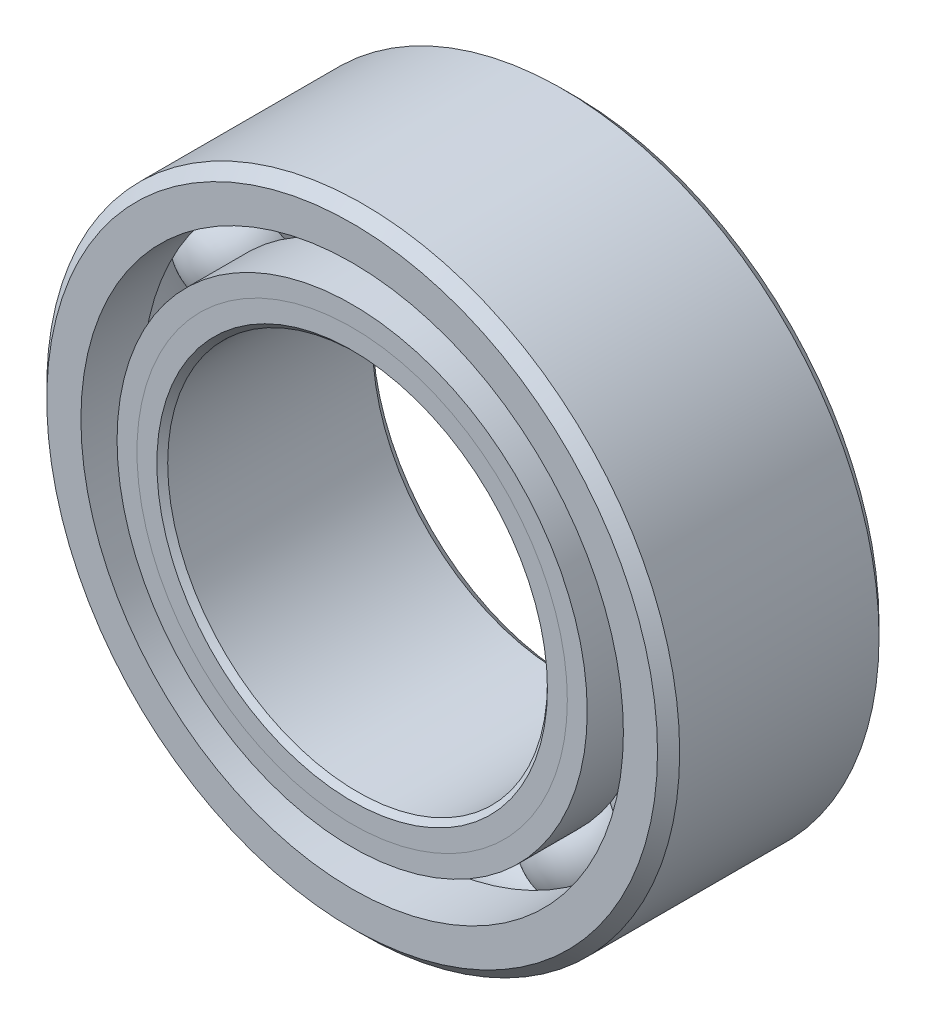
ISO-10303-21;
HEADER;
FILE_DESCRIPTION(('STEP AP214'),'2;1');
FILE_NAME('part.step','',(''),(''),'','','');
FILE_SCHEMA(('AUTOMOTIVE_DESIGN { 1 0 10303 214 1 1 1 1 }'));
ENDSEC;
DATA;
#1=APPLICATION_CONTEXT('core data for automotive mechanical design processes');
#2=APPLICATION_PROTOCOL_DEFINITION('international standard','automotive_design',2000,#1);
#3=PRODUCT_CONTEXT('',#1,'mechanical');
#4=PRODUCT('Part','Part','',(#3));
#5=PRODUCT_RELATED_PRODUCT_CATEGORY('part','',(#4));
#6=PRODUCT_DEFINITION_FORMATION('','',#4);
#7=PRODUCT_DEFINITION_CONTEXT('part definition',#1,'design');
#8=PRODUCT_DEFINITION('design','',#6,#7);
#9=PRODUCT_DEFINITION_SHAPE('','',#8);
#10=(LENGTH_UNIT() NAMED_UNIT(*) SI_UNIT(.MILLI.,.METRE.));
#11=(NAMED_UNIT(*) PLANE_ANGLE_UNIT() SI_UNIT($,.RADIAN.));
#12=(NAMED_UNIT(*) SI_UNIT($,.STERADIAN.) SOLID_ANGLE_UNIT());
#13=UNCERTAINTY_MEASURE_WITH_UNIT(LENGTH_MEASURE(1.E-05),#10,'distance_accuracy_value','');
#14=(GEOMETRIC_REPRESENTATION_CONTEXT(3) GLOBAL_UNCERTAINTY_ASSIGNED_CONTEXT((#13)) GLOBAL_UNIT_ASSIGNED_CONTEXT((#10,
#11,#12)) REPRESENTATION_CONTEXT('',''));
#15=CARTESIAN_POINT('',(0.,0.,0.));
#16=DIRECTION('',(0.,0.,1.));
#17=DIRECTION('',(1.,0.,0.));
#18=AXIS2_PLACEMENT_3D('',#15,#16,#17);
#19=CARTESIAN_POINT('',(-1.58749999999996,2.74963065701561,0.));
#20=DIRECTION('',(0.,0.,1.));
#21=DIRECTION('',(-0.499999999999989,0.866025403784445,0.));
#22=AXIS2_PLACEMENT_3D('',#19,#20,#21);
#23=SPHERICAL_SURFACE('',#22,0.657697880273631);
#24=CARTESIAN_POINT('',(-1.58749999999996,2.74963065701561,0.65769788027363));
#25=VERTEX_POINT('',#24);
#26=VERTEX_LOOP('',#25);
#27=FACE_BOUND('',#26,.T.);
#28=ADVANCED_FACE('F39',(#27),#23,.T.);
#29=CLOSED_SHELL('',(#28));
#30=MANIFOLD_SOLID_BREP('B2',#29);
#31=CARTESIAN_POINT('',(-2.74963065701557,1.58750000000003,0.));
#32=DIRECTION('',(0.,0.,1.));
#33=DIRECTION('',(-0.866025403784433,0.50000000000001,0.));
#34=AXIS2_PLACEMENT_3D('',#31,#32,#33);
#35=SPHERICAL_SURFACE('',#34,0.657697880273631);
#36=CARTESIAN_POINT('',(-2.74963065701557,1.58750000000003,0.65769788027363));
#37=VERTEX_POINT('',#36);
#38=VERTEX_LOOP('',#37);
#39=FACE_BOUND('',#38,.T.);
#40=ADVANCED_FACE('F72',(#39),#35,.T.);
#41=CLOSED_SHELL('',(#40));
#42=MANIFOLD_SOLID_BREP('B6',#41);
#43=CARTESIAN_POINT('',(-3.175,0.,0.));
#44=DIRECTION('',(0.,0.,1.));
#45=DIRECTION('',(-1.,0.,0.));
#46=AXIS2_PLACEMENT_3D('',#43,#44,#45);
#47=SPHERICAL_SURFACE('',#46,0.657697880273631);
#48=CARTESIAN_POINT('',(-3.175,0.,0.65769788027363));
#49=VERTEX_POINT('',#48);
#50=VERTEX_LOOP('',#49);
#51=FACE_BOUND('',#50,.T.);
#52=ADVANCED_FACE('F105',(#51),#47,.T.);
#53=CLOSED_SHELL('',(#52));
#54=MANIFOLD_SOLID_BREP('B35',#53);
#55=CARTESIAN_POINT('',(-2.74963065701561,-1.58749999999997,0.));
#56=DIRECTION('',(0.,0.,1.));
#57=DIRECTION('',(-0.866025403784443,-0.499999999999992,0.));
#58=AXIS2_PLACEMENT_3D('',#55,#56,#57);
#59=SPHERICAL_SURFACE('',#58,0.657697880273631);
#60=CARTESIAN_POINT('',(-2.74963065701561,-1.58749999999997,0.65769788027363));
#61=VERTEX_POINT('',#60);
#62=VERTEX_LOOP('',#61);
#63=FACE_BOUND('',#62,.T.);
#64=ADVANCED_FACE('F138',(#63),#59,.T.);
#65=CLOSED_SHELL('',(#64));
#66=MANIFOLD_SOLID_BREP('B68',#65);
#67=CARTESIAN_POINT('',(-1.58750000000002,-2.74963065701558,0.));
#68=DIRECTION('',(0.,0.,1.));
#69=DIRECTION('',(-0.500000000000007,-0.866025403784435,0.));
#70=AXIS2_PLACEMENT_3D('',#67,#68,#69);
#71=SPHERICAL_SURFACE('',#70,0.657697880273631);
#72=CARTESIAN_POINT('',(-1.58750000000002,-2.74963065701558,0.65769788027363));
#73=VERTEX_POINT('',#72);
#74=VERTEX_LOOP('',#73);
#75=FACE_BOUND('',#74,.T.);
#76=ADVANCED_FACE('F171',(#75),#71,.T.);
#77=CLOSED_SHELL('',(#76));
#78=MANIFOLD_SOLID_BREP('B101',#77);
#79=CARTESIAN_POINT('',(0.,-3.175,0.));
#80=DIRECTION('',(0.,0.,1.));
#81=DIRECTION('',(0.,-1.,0.));
#82=AXIS2_PLACEMENT_3D('',#79,#80,#81);
#83=SPHERICAL_SURFACE('',#82,0.657697880273631);
#84=CARTESIAN_POINT('',(0.,-3.175,0.65769788027363));
#85=VERTEX_POINT('',#84);
#86=VERTEX_LOOP('',#85);
#87=FACE_BOUND('',#86,.T.);
#88=ADVANCED_FACE('F204',(#87),#83,.T.);
#89=CLOSED_SHELL('',(#88));
#90=MANIFOLD_SOLID_BREP('B134',#89);
#91=CARTESIAN_POINT('',(1.58749999999998,-2.7496306570156,0.));
#92=DIRECTION('',(0.,0.,1.));
#93=DIRECTION('',(0.499999999999995,-0.866025403784442,0.));
#94=AXIS2_PLACEMENT_3D('',#91,#92,#93);
#95=SPHERICAL_SURFACE('',#94,0.657697880273631);
#96=CARTESIAN_POINT('',(1.58749999999998,-2.7496306570156,0.65769788027363));
#97=VERTEX_POINT('',#96);
#98=VERTEX_LOOP('',#97);
#99=FACE_BOUND('',#98,.T.);
#100=ADVANCED_FACE('F237',(#99),#95,.T.);
#101=CLOSED_SHELL('',(#100));
#102=MANIFOLD_SOLID_BREP('B167',#101);
#103=CARTESIAN_POINT('',(2.74963065701559,-1.58750000000001,0.));
#104=DIRECTION('',(0.,0.,1.));
#105=DIRECTION('',(0.866025403784436,-0.500000000000004,0.));
#106=AXIS2_PLACEMENT_3D('',#103,#104,#105);
#107=SPHERICAL_SURFACE('',#106,0.657697880273631);
#108=CARTESIAN_POINT('',(2.74963065701559,-1.58750000000001,0.65769788027363));
#109=VERTEX_POINT('',#108);
#110=VERTEX_LOOP('',#109);
#111=FACE_BOUND('',#110,.T.);
#112=ADVANCED_FACE('F270',(#111),#107,.T.);
#113=CLOSED_SHELL('',(#112));
#114=MANIFOLD_SOLID_BREP('B200',#113);
#115=CARTESIAN_POINT('',(3.175,0.,0.));
#116=DIRECTION('',(0.,0.,1.));
#117=DIRECTION('',(1.,0.,0.));
#118=AXIS2_PLACEMENT_3D('',#115,#116,#117);
#119=SPHERICAL_SURFACE('',#118,0.657697880273631);
#120=CARTESIAN_POINT('',(3.175,0.,0.65769788027363));
#121=VERTEX_POINT('',#120);
#122=VERTEX_LOOP('',#121);
#123=FACE_BOUND('',#122,.T.);
#124=ADVANCED_FACE('F303',(#123),#119,.T.);
#125=CLOSED_SHELL('',(#124));
#126=MANIFOLD_SOLID_BREP('B233',#125);
#127=CARTESIAN_POINT('',(2.7496306570156,1.58749999999999,0.));
#128=DIRECTION('',(0.,0.,1.));
#129=DIRECTION('',(0.86602540378444,0.499999999999998,0.));
#130=AXIS2_PLACEMENT_3D('',#127,#128,#129);
#131=SPHERICAL_SURFACE('',#130,0.657697880273631);
#132=CARTESIAN_POINT('',(2.7496306570156,1.58749999999999,0.65769788027363));
#133=VERTEX_POINT('',#132);
#134=VERTEX_LOOP('',#133);
#135=FACE_BOUND('',#134,.T.);
#136=ADVANCED_FACE('F336',(#135),#131,.T.);
#137=CLOSED_SHELL('',(#136));
#138=MANIFOLD_SOLID_BREP('B266',#137);
#139=CARTESIAN_POINT('',(1.5875,2.74963065701559,0.));
#140=DIRECTION('',(0.,0.,1.));
#141=DIRECTION('',(0.500000000000001,0.866025403784438,0.));
#142=AXIS2_PLACEMENT_3D('',#139,#140,#141);
#143=SPHERICAL_SURFACE('',#142,0.657697880273631);
#144=CARTESIAN_POINT('',(1.5875,2.74963065701559,0.65769788027363));
#145=VERTEX_POINT('',#144);
#146=VERTEX_LOOP('',#145);
#147=FACE_BOUND('',#146,.T.);
#148=ADVANCED_FACE('F369',(#147),#143,.T.);
#149=CLOSED_SHELL('',(#148));
#150=MANIFOLD_SOLID_BREP('B299',#149);
#151=CARTESIAN_POINT('',(0.,3.175,0.));
#152=DIRECTION('',(0.,0.,1.));
#153=DIRECTION('',(0.,1.,0.));
#154=AXIS2_PLACEMENT_3D('',#151,#152,#153);
#155=SPHERICAL_SURFACE('',#154,0.657697880273631);
#156=CARTESIAN_POINT('',(0.,3.175,0.65769788027363));
#157=VERTEX_POINT('',#156);
#158=VERTEX_LOOP('',#157);
#159=FACE_BOUND('',#158,.T.);
#160=ADVANCED_FACE('F404',(#159),#155,.T.);
#161=CLOSED_SHELL('',(#160));
#162=MANIFOLD_SOLID_BREP('B332',#161);
#163=CARTESIAN_POINT('',(0.,2.69874517278874,1.3890625));
#164=DIRECTION('',(0.,0.,-1.));
#165=DIRECTION('',(-1.,0.,0.));
#166=AXIS2_PLACEMENT_3D('',#163,#164,#165);
#167=PLANE('',#166);
#168=CARTESIAN_POINT('',(0.,0.,1.3890625));
#169=DIRECTION('',(0.,0.,1.));
#170=DIRECTION('',(1.,0.,0.));
#171=AXIS2_PLACEMENT_3D('',#168,#169,#170);
#172=CIRCLE('',#171,2.44927605986318);
#173=CARTESIAN_POINT('',(2.44927605986318,0.,1.3890625));
#174=VERTEX_POINT('',#173);
#175=EDGE_CURVE('E458',#174,#174,#172,.T.);
#176=ORIENTED_EDGE('',*,*,#175,.F.);
#177=EDGE_LOOP('',(#176));
#178=FACE_BOUND('',#177,.T.);
#179=CARTESIAN_POINT('',(0.,0.,1.3890625));
#180=DIRECTION('',(0.,0.,1.));
#181=DIRECTION('',(1.,0.,0.));
#182=AXIS2_PLACEMENT_3D('',#179,#180,#181);
#183=CIRCLE('',#182,2.69874517278874);
#184=CARTESIAN_POINT('',(2.69874517278874,0.,1.3890625));
#185=VERTEX_POINT('',#184);
#186=EDGE_CURVE('E403',#185,#185,#183,.T.);
#187=ORIENTED_EDGE('',*,*,#186,.T.);
#188=EDGE_LOOP('',(#187));
#189=FACE_BOUND('',#188,.T.);
#190=ADVANCED_FACE('F424',(#178,#189),#167,.F.);
#191=CARTESIAN_POINT('',(0.,0.,1.13959338707445));
#192=DIRECTION('',(0.,0.,1.));
#193=DIRECTION('',(1.,0.,0.));
#194=AXIS2_PLACEMENT_3D('',#191,#192,#193);
#195=CONICAL_SURFACE('',#194,2.44927605986318,0.78539816339745);
#196=ORIENTED_EDGE('',*,*,#186,.F.);
#197=EDGE_LOOP('',(#196));
#198=FACE_BOUND('',#197,.T.);
#199=CARTESIAN_POINT('',(0.,0.,1.13959338707445));
#200=DIRECTION('',(0.,0.,1.));
#201=DIRECTION('',(1.,0.,0.));
#202=AXIS2_PLACEMENT_3D('',#199,#200,#201);
#203=CIRCLE('',#202,2.44927605986318);
#204=CARTESIAN_POINT('',(2.44927605986318,0.,1.13959338707445));
#205=VERTEX_POINT('',#204);
#206=EDGE_CURVE('E430',#205,#205,#203,.T.);
#207=ORIENTED_EDGE('',*,*,#206,.T.);
#208=EDGE_LOOP('',(#207));
#209=FACE_BOUND('',#208,.T.);
#210=ADVANCED_FACE('F465',(#198,#209),#195,.T.);
#211=CARTESIAN_POINT('',(0.,0.,1.3890625));
#212=DIRECTION('',(0.,0.,1.));
#213=DIRECTION('',(1.,0.,0.));
#214=AXIS2_PLACEMENT_3D('',#211,#212,#213);
#215=CYLINDRICAL_SURFACE('',#214,2.44927605986318);
#216=ORIENTED_EDGE('',*,*,#206,.F.);
#217=EDGE_LOOP('',(#216));
#218=FACE_BOUND('',#217,.T.);
#219=CARTESIAN_POINT('',(0.,0.,0.));
#220=DIRECTION('',(0.,0.,1.));
#221=DIRECTION('',(1.,0.,0.));
#222=AXIS2_PLACEMENT_3D('',#219,#220,#221);
#223=CIRCLE('',#222,2.44927605986318);
#224=CARTESIAN_POINT('',(2.44927605986318,0.,0.));
#225=VERTEX_POINT('',#224);
#226=EDGE_CURVE('E434',#225,#225,#223,.T.);
#227=ORIENTED_EDGE('',*,*,#226,.T.);
#228=EDGE_LOOP('',(#227));
#229=FACE_BOUND('',#228,.T.);
#230=ADVANCED_FACE('F469',(#218,#229),#215,.T.);
#231=CARTESIAN_POINT('',(0.,2.44927605986318,0.));
#232=DIRECTION('',(0.,0.,-1.));
#233=DIRECTION('',(-1.,0.,0.));
#234=AXIS2_PLACEMENT_3D('',#231,#232,#233);
#235=PLANE('',#234);
#236=ORIENTED_EDGE('',*,*,#226,.F.);
#237=EDGE_LOOP('',(#236));
#238=FACE_BOUND('',#237,.T.);
#239=CARTESIAN_POINT('',(0.,0.,0.));
#240=DIRECTION('',(0.,0.,1.));
#241=DIRECTION('',(1.,0.,0.));
#242=AXIS2_PLACEMENT_3D('',#239,#240,#241);
#243=CIRCLE('',#242,2.51730211972637);
#244=CARTESIAN_POINT('',(2.51730211972637,0.,0.));
#245=VERTEX_POINT('',#244);
#246=EDGE_CURVE('E438',#245,#245,#243,.T.);
#247=ORIENTED_EDGE('',*,*,#246,.T.);
#248=EDGE_LOOP('',(#247));
#249=FACE_BOUND('',#248,.T.);
#250=ADVANCED_FACE('F474',(#238,#249),#235,.F.);
#251=CARTESIAN_POINT('',(0.,0.,0.));
#252=DIRECTION('',(0.,0.,1.));
#253=DIRECTION('',(1.,0.,0.));
#254=AXIS2_PLACEMENT_3D('',#251,#252,#253);
#255=TOROIDAL_SURFACE('',#254,3.175,0.65769788027363);
#256=ORIENTED_EDGE('',*,*,#246,.F.);
#257=EDGE_LOOP('',(#256));
#258=FACE_BOUND('',#257,.T.);
#259=CARTESIAN_POINT('',(0.,0.,-0.617361111111111));
#260=DIRECTION('',(0.,0.,1.));
#261=DIRECTION('',(1.,0.,0.));
#262=AXIS2_PLACEMENT_3D('',#259,#260,#261);
#263=CIRCLE('',#262,2.94821428571429);
#264=CARTESIAN_POINT('',(2.94821428571429,0.,-0.617361111111111));
#265=VERTEX_POINT('',#264);
#266=EDGE_CURVE('E443',#265,#265,#263,.T.);
#267=ORIENTED_EDGE('',*,*,#266,.T.);
#268=EDGE_LOOP('',(#267));
#269=FACE_BOUND('',#268,.T.);
#270=ADVANCED_FACE('F480',(#258,#269),#255,.F.);
#271=CARTESIAN_POINT('',(0.,0.,1.3890625));
#272=DIRECTION('',(0.,0.,1.));
#273=DIRECTION('',(1.,0.,0.));
#274=AXIS2_PLACEMENT_3D('',#271,#272,#273);
#275=CYLINDRICAL_SURFACE('',#274,2.94821428571429);
#276=ORIENTED_EDGE('',*,*,#266,.F.);
#277=EDGE_LOOP('',(#276));
#278=FACE_BOUND('',#277,.T.);
#279=CARTESIAN_POINT('',(0.,0.,-1.3890625));
#280=DIRECTION('',(0.,0.,1.));
#281=DIRECTION('',(1.,0.,0.));
#282=AXIS2_PLACEMENT_3D('',#279,#280,#281);
#283=CIRCLE('',#282,2.94821428571429);
#284=CARTESIAN_POINT('',(2.94821428571429,0.,-1.3890625));
#285=VERTEX_POINT('',#284);
#286=EDGE_CURVE('E446',#285,#285,#283,.T.);
#287=ORIENTED_EDGE('',*,*,#286,.T.);
#288=EDGE_LOOP('',(#287));
#289=FACE_BOUND('',#288,.T.);
#290=ADVANCED_FACE('F484',(#278,#289),#275,.T.);
#291=CARTESIAN_POINT('',(0.,2.52015625,-1.3890625));
#292=DIRECTION('',(0.,0.,1.));
#293=DIRECTION('',(1.,0.,0.));
#294=AXIS2_PLACEMENT_3D('',#291,#292,#293);
#295=PLANE('',#294);
#296=ORIENTED_EDGE('',*,*,#286,.F.);
#297=EDGE_LOOP('',(#296));
#298=FACE_BOUND('',#297,.T.);
#299=CARTESIAN_POINT('',(0.,0.,-1.3890625));
#300=DIRECTION('',(0.,0.,1.));
#301=DIRECTION('',(1.,0.,0.));
#302=AXIS2_PLACEMENT_3D('',#299,#300,#301);
#303=CIRCLE('',#302,2.52015625);
#304=CARTESIAN_POINT('',(2.52015625,0.,-1.3890625));
#305=VERTEX_POINT('',#304);
#306=EDGE_CURVE('E449',#305,#305,#303,.T.);
#307=ORIENTED_EDGE('',*,*,#306,.T.);
#308=EDGE_LOOP('',(#307));
#309=FACE_BOUND('',#308,.T.);
#310=ADVANCED_FACE('F488',(#298,#309),#295,.F.);
#311=CARTESIAN_POINT('',(0.,0.,-1.25015625));
#312=DIRECTION('',(0.,0.,-1.));
#313=DIRECTION('',(-1.,0.,0.));
#314=AXIS2_PLACEMENT_3D('',#311,#312,#313);
#315=CONICAL_SURFACE('',#314,2.38125,0.78539816339745);
#316=ORIENTED_EDGE('',*,*,#306,.F.);
#317=EDGE_LOOP('',(#316));
#318=FACE_BOUND('',#317,.T.);
#319=CARTESIAN_POINT('',(0.,0.,-1.25015625));
#320=DIRECTION('',(0.,0.,1.));
#321=DIRECTION('',(1.,0.,0.));
#322=AXIS2_PLACEMENT_3D('',#319,#320,#321);
#323=CIRCLE('',#322,2.38125);
#324=CARTESIAN_POINT('',(2.38125,0.,-1.25015625));
#325=VERTEX_POINT('',#324);
#326=EDGE_CURVE('E452',#325,#325,#323,.T.);
#327=ORIENTED_EDGE('',*,*,#326,.T.);
#328=EDGE_LOOP('',(#327));
#329=FACE_BOUND('',#328,.T.);
#330=ADVANCED_FACE('F492',(#318,#329),#315,.F.);
#331=CARTESIAN_POINT('',(0.,0.,1.3890625));
#332=DIRECTION('',(0.,0.,1.));
#333=DIRECTION('',(1.,0.,0.));
#334=AXIS2_PLACEMENT_3D('',#331,#332,#333);
#335=CYLINDRICAL_SURFACE('',#334,2.38125);
#336=ORIENTED_EDGE('',*,*,#326,.F.);
#337=EDGE_LOOP('',(#336));
#338=FACE_BOUND('',#337,.T.);
#339=CARTESIAN_POINT('',(0.,0.,1.32103644013682));
#340=DIRECTION('',(0.,0.,1.));
#341=DIRECTION('',(1.,0.,0.));
#342=AXIS2_PLACEMENT_3D('',#339,#340,#341);
#343=CIRCLE('',#342,2.38125);
#344=CARTESIAN_POINT('',(2.38125,0.,1.32103644013682));
#345=VERTEX_POINT('',#344);
#346=EDGE_CURVE('E455',#345,#345,#343,.T.);
#347=ORIENTED_EDGE('',*,*,#346,.T.);
#348=EDGE_LOOP('',(#347));
#349=FACE_BOUND('',#348,.T.);
#350=ADVANCED_FACE('F496',(#338,#349),#335,.F.);
#351=CARTESIAN_POINT('',(0.,0.,1.3890625));
#352=DIRECTION('',(0.,0.,1.));
#353=DIRECTION('',(1.,0.,0.));
#354=AXIS2_PLACEMENT_3D('',#351,#352,#353);
#355=CONICAL_SURFACE('',#354,2.44927605986318,0.785398163397453);
#356=ORIENTED_EDGE('',*,*,#346,.F.);
#357=EDGE_LOOP('',(#356));
#358=FACE_BOUND('',#357,.T.);
#359=ORIENTED_EDGE('',*,*,#175,.T.);
#360=EDGE_LOOP('',(#359));
#361=FACE_BOUND('',#360,.T.);
#362=ADVANCED_FACE('F462',(#358,#361),#355,.F.);
#363=CLOSED_SHELL('',(#190,#210,#230,#250,#270,#290,#310,#330,#350,#362));
#364=MANIFOLD_SOLID_BREP('B365',#363);
#365=CARTESIAN_POINT('',(0.,2.94821428571429,1.3890625));
#366=DIRECTION('',(0.,0.,-1.));
#367=DIRECTION('',(-1.,0.,0.));
#368=AXIS2_PLACEMENT_3D('',#365,#366,#367);
#369=PLANE('',#368);
#370=CARTESIAN_POINT('',(0.,0.,1.3890625));
#371=DIRECTION('',(0.,0.,1.));
#372=DIRECTION('',(1.,0.,0.));
#373=AXIS2_PLACEMENT_3D('',#370,#371,#372);
#374=CIRCLE('',#373,2.69874517278874);
#375=CARTESIAN_POINT('',(2.69874517278874,0.,1.3890625));
#376=VERTEX_POINT('',#375);
#377=EDGE_CURVE('E423',#376,#376,#374,.T.);
#378=ORIENTED_EDGE('',*,*,#377,.F.);
#379=EDGE_LOOP('',(#378));
#380=FACE_BOUND('',#379,.T.);
#381=CARTESIAN_POINT('',(0.,0.,1.3890625));
#382=DIRECTION('',(0.,0.,1.));
#383=DIRECTION('',(1.,0.,0.));
#384=AXIS2_PLACEMENT_3D('',#381,#382,#383);
#385=CIRCLE('',#384,2.94821428571429);
#386=CARTESIAN_POINT('',(2.94821428571429,0.,1.3890625));
#387=VERTEX_POINT('',#386);
#388=EDGE_CURVE('E604',#387,#387,#385,.T.);
#389=ORIENTED_EDGE('',*,*,#388,.T.);
#390=EDGE_LOOP('',(#389));
#391=FACE_BOUND('',#390,.T.);
#392=ADVANCED_FACE('F582',(#380,#391),#369,.F.);
#393=CARTESIAN_POINT('',(0.,0.,1.3890625));
#394=DIRECTION('',(0.,0.,1.));
#395=DIRECTION('',(1.,0.,0.));
#396=AXIS2_PLACEMENT_3D('',#393,#394,#395);
#397=CONICAL_SURFACE('',#396,2.69874517278874,0.78539816339745);
#398=CARTESIAN_POINT('',(0.,0.,1.13959338707445));
#399=DIRECTION('',(0.,0.,1.));
#400=DIRECTION('',(1.,0.,0.));
#401=AXIS2_PLACEMENT_3D('',#398,#399,#400);
#402=CIRCLE('',#401,2.44927605986318);
#403=CARTESIAN_POINT('',(2.44927605986318,0.,1.13959338707445));
#404=VERTEX_POINT('',#403);
#405=EDGE_CURVE('E588',#404,#404,#402,.T.);
#406=ORIENTED_EDGE('',*,*,#405,.F.);
#407=EDGE_LOOP('',(#406));
#408=FACE_BOUND('',#407,.T.);
#409=ORIENTED_EDGE('',*,*,#377,.T.);
#410=EDGE_LOOP('',(#409));
#411=FACE_BOUND('',#410,.T.);
#412=ADVANCED_FACE('F629',(#408,#411),#397,.F.);
#413=CARTESIAN_POINT('',(0.,0.,1.3890625));
#414=DIRECTION('',(0.,0.,1.));
#415=DIRECTION('',(1.,0.,0.));
#416=AXIS2_PLACEMENT_3D('',#413,#414,#415);
#417=CYLINDRICAL_SURFACE('',#416,2.44927605986318);
#418=CARTESIAN_POINT('',(0.,0.,0.));
#419=DIRECTION('',(0.,0.,1.));
#420=DIRECTION('',(1.,0.,0.));
#421=AXIS2_PLACEMENT_3D('',#418,#419,#420);
#422=CIRCLE('',#421,2.44927605986318);
#423=CARTESIAN_POINT('',(2.44927605986318,0.,0.));
#424=VERTEX_POINT('',#423);
#425=EDGE_CURVE('E592',#424,#424,#422,.T.);
#426=ORIENTED_EDGE('',*,*,#425,.F.);
#427=EDGE_LOOP('',(#426));
#428=FACE_BOUND('',#427,.T.);
#429=ORIENTED_EDGE('',*,*,#405,.T.);
#430=EDGE_LOOP('',(#429));
#431=FACE_BOUND('',#430,.T.);
#432=ADVANCED_FACE('F624',(#428,#431),#417,.F.);
#433=CARTESIAN_POINT('',(0.,2.44927605986318,0.));
#434=DIRECTION('',(0.,0.,1.));
#435=DIRECTION('',(1.,0.,0.));
#436=AXIS2_PLACEMENT_3D('',#433,#434,#435);
#437=PLANE('',#436);
#438=CARTESIAN_POINT('',(0.,0.,0.));
#439=DIRECTION('',(0.,0.,1.));
#440=DIRECTION('',(1.,0.,0.));
#441=AXIS2_PLACEMENT_3D('',#438,#439,#440);
#442=CIRCLE('',#441,2.51730211972637);
#443=CARTESIAN_POINT('',(2.51730211972637,0.,0.));
#444=VERTEX_POINT('',#443);
#445=EDGE_CURVE('E596',#444,#444,#442,.T.);
#446=ORIENTED_EDGE('',*,*,#445,.F.);
#447=EDGE_LOOP('',(#446));
#448=FACE_BOUND('',#447,.T.);
#449=ORIENTED_EDGE('',*,*,#425,.T.);
#450=EDGE_LOOP('',(#449));
#451=FACE_BOUND('',#450,.T.);
#452=ADVANCED_FACE('F618',(#448,#451),#437,.F.);
#453=CARTESIAN_POINT('',(0.,0.,0.));
#454=DIRECTION('',(0.,0.,1.));
#455=DIRECTION('',(1.,0.,0.));
#456=AXIS2_PLACEMENT_3D('',#453,#454,#455);
#457=TOROIDAL_SURFACE('',#456,3.175,0.657697880273631);
#458=CARTESIAN_POINT('',(0.,0.,0.617361111111111));
#459=DIRECTION('',(0.,0.,1.));
#460=DIRECTION('',(1.,0.,0.));
#461=AXIS2_PLACEMENT_3D('',#458,#459,#460);
#462=CIRCLE('',#461,2.94821428571429);
#463=CARTESIAN_POINT('',(2.94821428571429,0.,0.617361111111111));
#464=VERTEX_POINT('',#463);
#465=EDGE_CURVE('E601',#464,#464,#462,.T.);
#466=ORIENTED_EDGE('',*,*,#465,.F.);
#467=EDGE_LOOP('',(#466));
#468=FACE_BOUND('',#467,.T.);
#469=ORIENTED_EDGE('',*,*,#445,.T.);
#470=EDGE_LOOP('',(#469));
#471=FACE_BOUND('',#470,.T.);
#472=ADVANCED_FACE('F612',(#468,#471),#457,.F.);
#473=CARTESIAN_POINT('',(0.,0.,1.3890625));
#474=DIRECTION('',(0.,0.,1.));
#475=DIRECTION('',(1.,0.,0.));
#476=AXIS2_PLACEMENT_3D('',#473,#474,#475);
#477=CYLINDRICAL_SURFACE('',#476,2.94821428571429);
#478=ORIENTED_EDGE('',*,*,#388,.F.);
#479=EDGE_LOOP('',(#478));
#480=FACE_BOUND('',#479,.T.);
#481=ORIENTED_EDGE('',*,*,#465,.T.);
#482=EDGE_LOOP('',(#481));
#483=FACE_BOUND('',#482,.T.);
#484=ADVANCED_FACE('F609',(#480,#483),#477,.T.);
#485=CLOSED_SHELL('',(#392,#412,#432,#452,#472,#484));
#486=MANIFOLD_SOLID_BREP('B398',#485);
#487=CARTESIAN_POINT('',(0.,0.,1.25015625));
#488=DIRECTION('',(0.,0.,-1.));
#489=DIRECTION('',(-1.,0.,0.));
#490=AXIS2_PLACEMENT_3D('',#487,#488,#489);
#491=CONICAL_SURFACE('',#490,3.96875,0.785398163397445);
#492=CARTESIAN_POINT('',(0.,0.,1.3890625));
#493=DIRECTION('',(0.,0.,1.));
#494=DIRECTION('',(1.,0.,0.));
#495=AXIS2_PLACEMENT_3D('',#492,#493,#494);
#496=CIRCLE('',#495,3.82984375);
#497=CARTESIAN_POINT('',(3.82984375,0.,1.3890625));
#498=VERTEX_POINT('',#497);
#499=EDGE_CURVE('E701',#498,#498,#496,.T.);
#500=ORIENTED_EDGE('',*,*,#499,.F.);
#501=EDGE_LOOP('',(#500));
#502=FACE_BOUND('',#501,.T.);
#503=CARTESIAN_POINT('',(0.,0.,1.25015625));
#504=DIRECTION('',(0.,0.,1.));
#505=DIRECTION('',(1.,0.,0.));
#506=AXIS2_PLACEMENT_3D('',#503,#504,#505);
#507=CIRCLE('',#506,3.96875);
#508=CARTESIAN_POINT('',(3.96875,0.,1.25015625));
#509=VERTEX_POINT('',#508);
#510=EDGE_CURVE('E581',#509,#509,#507,.T.);
#511=ORIENTED_EDGE('',*,*,#510,.T.);
#512=EDGE_LOOP('',(#511));
#513=FACE_BOUND('',#512,.T.);
#514=ADVANCED_FACE('F673',(#502,#513),#491,.T.);
#515=CARTESIAN_POINT('',(0.,0.,1.3890625));
#516=DIRECTION('',(0.,0.,1.));
#517=DIRECTION('',(1.,0.,0.));
#518=AXIS2_PLACEMENT_3D('',#515,#516,#517);
#519=CYLINDRICAL_SURFACE('',#518,3.96875);
#520=ORIENTED_EDGE('',*,*,#510,.F.);
#521=EDGE_LOOP('',(#520));
#522=FACE_BOUND('',#521,.T.);
#523=CARTESIAN_POINT('',(0.,0.,-1.25015625));
#524=DIRECTION('',(0.,0.,1.));
#525=DIRECTION('',(1.,0.,0.));
#526=AXIS2_PLACEMENT_3D('',#523,#524,#525);
#527=CIRCLE('',#526,3.96875);
#528=CARTESIAN_POINT('',(3.96875,0.,-1.25015625));
#529=VERTEX_POINT('',#528);
#530=EDGE_CURVE('E679',#529,#529,#527,.T.);
#531=ORIENTED_EDGE('',*,*,#530,.T.);
#532=EDGE_LOOP('',(#531));
#533=FACE_BOUND('',#532,.T.);
#534=ADVANCED_FACE('F708',(#522,#533),#519,.T.);
#535=CARTESIAN_POINT('',(0.,0.,-1.3890625));
#536=DIRECTION('',(0.,0.,1.));
#537=DIRECTION('',(1.,0.,0.));
#538=AXIS2_PLACEMENT_3D('',#535,#536,#537);
#539=CONICAL_SURFACE('',#538,3.82984375,0.785398163397442);
#540=ORIENTED_EDGE('',*,*,#530,.F.);
#541=EDGE_LOOP('',(#540));
#542=FACE_BOUND('',#541,.T.);
#543=CARTESIAN_POINT('',(0.,0.,-1.3890625));
#544=DIRECTION('',(0.,0.,1.));
#545=DIRECTION('',(1.,0.,0.));
#546=AXIS2_PLACEMENT_3D('',#543,#544,#545);
#547=CIRCLE('',#546,3.82984375);
#548=CARTESIAN_POINT('',(3.82984375,0.,-1.3890625));
#549=VERTEX_POINT('',#548);
#550=EDGE_CURVE('E683',#549,#549,#547,.T.);
#551=ORIENTED_EDGE('',*,*,#550,.T.);
#552=EDGE_LOOP('',(#551));
#553=FACE_BOUND('',#552,.T.);
#554=ADVANCED_FACE('F712',(#542,#553),#539,.T.);
#555=CARTESIAN_POINT('',(0.,3.82984375,-1.3890625));
#556=DIRECTION('',(0.,0.,1.));
#557=DIRECTION('',(1.,0.,0.));
#558=AXIS2_PLACEMENT_3D('',#555,#556,#557);
#559=PLANE('',#558);
#560=ORIENTED_EDGE('',*,*,#550,.F.);
#561=EDGE_LOOP('',(#560));
#562=FACE_BOUND('',#561,.T.);
#563=CARTESIAN_POINT('',(0.,0.,-1.3890625));
#564=DIRECTION('',(0.,0.,1.));
#565=DIRECTION('',(1.,0.,0.));
#566=AXIS2_PLACEMENT_3D('',#563,#564,#565);
#567=CIRCLE('',#566,3.40178571428571);
#568=CARTESIAN_POINT('',(3.40178571428571,0.,-1.3890625));
#569=VERTEX_POINT('',#568);
#570=EDGE_CURVE('E687',#569,#569,#567,.T.);
#571=ORIENTED_EDGE('',*,*,#570,.T.);
#572=EDGE_LOOP('',(#571));
#573=FACE_BOUND('',#572,.T.);
#574=ADVANCED_FACE('F717',(#562,#573),#559,.F.);
#575=CARTESIAN_POINT('',(0.,0.,1.3890625));
#576=DIRECTION('',(0.,0.,1.));
#577=DIRECTION('',(1.,0.,0.));
#578=AXIS2_PLACEMENT_3D('',#575,#576,#577);
#579=CYLINDRICAL_SURFACE('',#578,3.40178571428571);
#580=ORIENTED_EDGE('',*,*,#570,.F.);
#581=EDGE_LOOP('',(#580));
#582=FACE_BOUND('',#581,.T.);
#583=CARTESIAN_POINT('',(0.,0.,-0.617361111111111));
#584=DIRECTION('',(0.,0.,1.));
#585=DIRECTION('',(1.,0.,0.));
#586=AXIS2_PLACEMENT_3D('',#583,#584,#585);
#587=CIRCLE('',#586,3.40178571428571);
#588=CARTESIAN_POINT('',(3.40178571428571,0.,-0.617361111111111));
#589=VERTEX_POINT('',#588);
#590=EDGE_CURVE('E692',#589,#589,#587,.T.);
#591=ORIENTED_EDGE('',*,*,#590,.T.);
#592=EDGE_LOOP('',(#591));
#593=FACE_BOUND('',#592,.T.);
#594=ADVANCED_FACE('F723',(#582,#593),#579,.F.);
#595=CARTESIAN_POINT('',(0.,0.,0.));
#596=DIRECTION('',(0.,0.,1.));
#597=DIRECTION('',(1.,0.,0.));
#598=AXIS2_PLACEMENT_3D('',#595,#596,#597);
#599=TOROIDAL_SURFACE('',#598,3.175,0.657697880273631);
#600=ORIENTED_EDGE('',*,*,#590,.F.);
#601=EDGE_LOOP('',(#600));
#602=FACE_BOUND('',#601,.T.);
#603=CARTESIAN_POINT('',(0.,0.,0.617361111111111));
#604=DIRECTION('',(0.,0.,1.));
#605=DIRECTION('',(1.,0.,0.));
#606=AXIS2_PLACEMENT_3D('',#603,#604,#605);
#607=CIRCLE('',#606,3.40178571428571);
#608=CARTESIAN_POINT('',(3.40178571428571,0.,0.617361111111111));
#609=VERTEX_POINT('',#608);
#610=EDGE_CURVE('E695',#609,#609,#607,.T.);
#611=ORIENTED_EDGE('',*,*,#610,.T.);
#612=EDGE_LOOP('',(#611));
#613=FACE_BOUND('',#612,.T.);
#614=ADVANCED_FACE('F727',(#602,#613),#599,.F.);
#615=CARTESIAN_POINT('',(0.,0.,1.3890625));
#616=DIRECTION('',(0.,0.,1.));
#617=DIRECTION('',(1.,0.,0.));
#618=AXIS2_PLACEMENT_3D('',#615,#616,#617);
#619=CYLINDRICAL_SURFACE('',#618,3.40178571428571);
#620=ORIENTED_EDGE('',*,*,#610,.F.);
#621=EDGE_LOOP('',(#620));
#622=FACE_BOUND('',#621,.T.);
#623=CARTESIAN_POINT('',(0.,0.,1.3890625));
#624=DIRECTION('',(0.,0.,1.));
#625=DIRECTION('',(1.,0.,0.));
#626=AXIS2_PLACEMENT_3D('',#623,#624,#625);
#627=CIRCLE('',#626,3.40178571428571);
#628=CARTESIAN_POINT('',(3.40178571428571,0.,1.3890625));
#629=VERTEX_POINT('',#628);
#630=EDGE_CURVE('E698',#629,#629,#627,.T.);
#631=ORIENTED_EDGE('',*,*,#630,.T.);
#632=EDGE_LOOP('',(#631));
#633=FACE_BOUND('',#632,.T.);
#634=ADVANCED_FACE('F731',(#622,#633),#619,.F.);
#635=CARTESIAN_POINT('',(0.,3.82984375,1.3890625));
#636=DIRECTION('',(0.,0.,-1.));
#637=DIRECTION('',(-1.,0.,0.));
#638=AXIS2_PLACEMENT_3D('',#635,#636,#637);
#639=PLANE('',#638);
#640=ORIENTED_EDGE('',*,*,#630,.F.);
#641=EDGE_LOOP('',(#640));
#642=FACE_BOUND('',#641,.T.);
#643=ORIENTED_EDGE('',*,*,#499,.T.);
#644=EDGE_LOOP('',(#643));
#645=FACE_BOUND('',#644,.T.);
#646=ADVANCED_FACE('F705',(#642,#645),#639,.F.);
#647=CLOSED_SHELL('',(#514,#534,#554,#574,#594,#614,#634,#646));
#648=MANIFOLD_SOLID_BREP('B418',#647);
#649=ADVANCED_BREP_SHAPE_REPRESENTATION('',(#18,#30,#42,#54,#66,#78,#90,#102,#114,#126,#138,
#150,#162,#364,#486,#648),#14);
#650=SHAPE_DEFINITION_REPRESENTATION(#9,#649);
ENDSEC;
END-ISO-10303-21;
